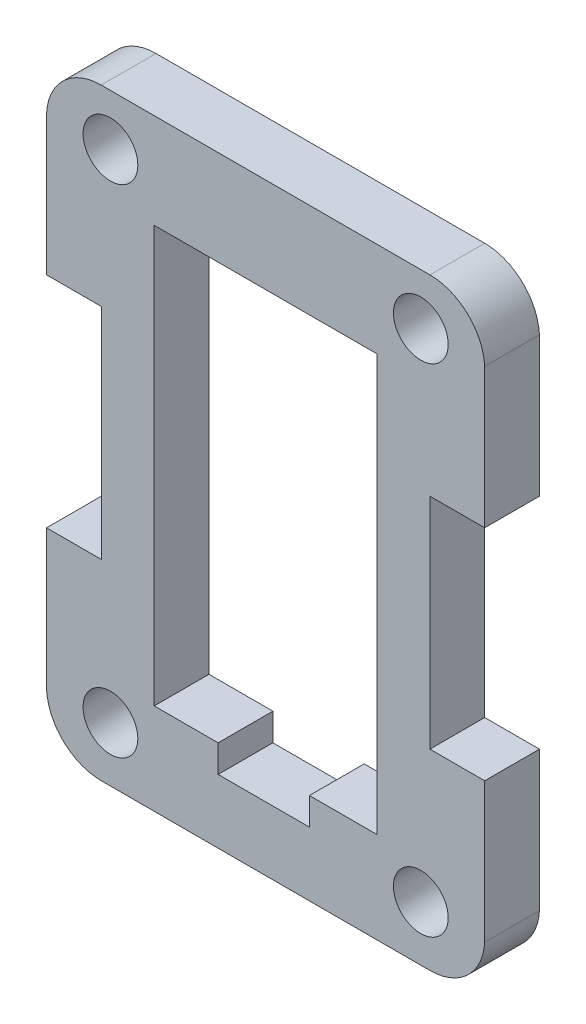
ISO-10303-21;
HEADER;
FILE_DESCRIPTION(('STEP AP214'),'2;1');
FILE_NAME('part.step','',(''),(''),'','','');
FILE_SCHEMA(('AUTOMOTIVE_DESIGN { 1 0 10303 214 1 1 1 1 }'));
ENDSEC;
DATA;
#1=APPLICATION_CONTEXT('core data for automotive mechanical design processes');
#2=APPLICATION_PROTOCOL_DEFINITION('international standard','automotive_design',2000,#1);
#3=PRODUCT_CONTEXT('',#1,'mechanical');
#4=PRODUCT('Part','Part','',(#3));
#5=PRODUCT_RELATED_PRODUCT_CATEGORY('part','',(#4));
#6=PRODUCT_DEFINITION_FORMATION('','',#4);
#7=PRODUCT_DEFINITION_CONTEXT('part definition',#1,'design');
#8=PRODUCT_DEFINITION('design','',#6,#7);
#9=PRODUCT_DEFINITION_SHAPE('','',#8);
#10=(LENGTH_UNIT() NAMED_UNIT(*) SI_UNIT(.MILLI.,.METRE.));
#11=(NAMED_UNIT(*) PLANE_ANGLE_UNIT() SI_UNIT($,.RADIAN.));
#12=(NAMED_UNIT(*) SI_UNIT($,.STERADIAN.) SOLID_ANGLE_UNIT());
#13=UNCERTAINTY_MEASURE_WITH_UNIT(LENGTH_MEASURE(1.E-05),#10,'distance_accuracy_value','');
#14=(GEOMETRIC_REPRESENTATION_CONTEXT(3) GLOBAL_UNCERTAINTY_ASSIGNED_CONTEXT((#13)) GLOBAL_UNIT_ASSIGNED_CONTEXT((#10,
#11,#12)) REPRESENTATION_CONTEXT('',''));
#15=CARTESIAN_POINT('',(0.,0.,0.));
#16=DIRECTION('',(0.,0.,1.));
#17=DIRECTION('',(1.,0.,0.));
#18=AXIS2_PLACEMENT_3D('',#15,#16,#17);
#19=CARTESIAN_POINT('',(44.9957202254101,26.4998748829452,3.));
#20=DIRECTION('',(0.,0.,1.));
#21=DIRECTION('',(1.,0.,0.));
#22=AXIS2_PLACEMENT_3D('',#19,#20,#21);
#23=PLANE('',#22);
#24=CARTESIAN_POINT('',(45.4999000000735,26.5000000049543,3.));
#25=DIRECTION('',(0.,0.,1.));
#26=DIRECTION('',(1.,0.,0.));
#27=AXIS2_PLACEMENT_3D('',#24,#25,#26);
#28=CIRCLE('',#27,1.50000000833415);
#29=CARTESIAN_POINT('',(46.9999000084077,26.5000000049543,3.));
#30=VERTEX_POINT('',#29);
#31=EDGE_CURVE('E266',#30,#30,#28,.T.);
#32=ORIENTED_EDGE('',*,*,#31,.F.);
#33=EDGE_LOOP('',(#32));
#34=FACE_BOUND('',#33,.T.);
#35=CARTESIAN_POINT('',(45.4999000000735,53.7000500066669,3.));
#36=DIRECTION('',(0.,0.,1.));
#37=DIRECTION('',(1.,0.,0.));
#38=AXIS2_PLACEMENT_3D('',#35,#36,#37);
#39=CIRCLE('',#38,1.5);
#40=CARTESIAN_POINT('',(46.9999000000735,53.7000500066669,3.));
#41=VERTEX_POINT('',#40);
#42=EDGE_CURVE('E278',#41,#41,#39,.T.);
#43=ORIENTED_EDGE('',*,*,#42,.F.);
#44=EDGE_LOOP('',(#43));
#45=FACE_BOUND('',#44,.T.);
#46=CARTESIAN_POINT('',(44.9957202254101,26.4998748829452,3.));
#47=DIRECTION('',(0.,0.,1.));
#48=DIRECTION('',(1.,0.,0.));
#49=AXIS2_PLACEMENT_3D('',#46,#47,#48);
#50=CIRCLE('',#49,2.99987488833183);
#51=CARTESIAN_POINT('',(41.99992086745,26.3435561301044,3.));
#52=VERTEX_POINT('',#51);
#53=CARTESIAN_POINT('',(44.9959,23.5,3.));
#54=VERTEX_POINT('',#53);
#55=EDGE_CURVE('E284',#52,#54,#50,.T.);
#56=ORIENTED_EDGE('',*,*,#55,.T.);
#57=DIRECTION('',(1.,0.,0.));
#58=VECTOR('',#57,1.);
#59=CARTESIAN_POINT('',(44.9959,23.5,3.));
#60=LINE('',#59,#58);
#61=CARTESIAN_POINT('',(62.9999000000001,23.5,3.));
#62=VERTEX_POINT('',#61);
#63=EDGE_CURVE('E287',#54,#62,#60,.T.);
#64=ORIENTED_EDGE('',*,*,#63,.T.);
#65=CARTESIAN_POINT('',(63.0041400352462,26.4998718918889,3.));
#66=DIRECTION('',(0.,0.,1.));
#67=DIRECTION('',(1.,0.,0.));
#68=AXIS2_PLACEMENT_3D('',#65,#66,#67);
#69=CIRCLE('',#68,2.99987488833178);
#70=CARTESIAN_POINT('',(65.9999,26.3428000000002,3.));
#71=VERTEX_POINT('',#70);
#72=EDGE_CURVE('E290',#62,#71,#69,.T.);
#73=ORIENTED_EDGE('',*,*,#72,.T.);
#74=DIRECTION('',(0.,1.,0.));
#75=VECTOR('',#74,1.);
#76=CARTESIAN_POINT('',(65.9999,34.,3.));
#77=LINE('',#76,#75);
#78=CARTESIAN_POINT('',(65.9999,34.,3.));
#79=VERTEX_POINT('',#78);
#80=EDGE_CURVE('E292',#71,#79,#77,.T.);
#81=ORIENTED_EDGE('',*,*,#80,.T.);
#82=DIRECTION('',(-1.,0.,0.));
#83=VECTOR('',#82,1.);
#84=CARTESIAN_POINT('',(65.9999,34.,3.));
#85=LINE('',#84,#83);
#86=CARTESIAN_POINT('',(62.9999,34.,3.));
#87=VERTEX_POINT('',#86);
#88=EDGE_CURVE('E294',#79,#87,#85,.T.);
#89=ORIENTED_EDGE('',*,*,#88,.T.);
#90=DIRECTION('',(0.,1.,0.));
#91=VECTOR('',#90,1.);
#92=CARTESIAN_POINT('',(62.9999,34.,3.));
#93=LINE('',#92,#91);
#94=CARTESIAN_POINT('',(62.9999,46.,3.));
#95=VERTEX_POINT('',#94);
#96=EDGE_CURVE('E296',#87,#95,#93,.T.);
#97=ORIENTED_EDGE('',*,*,#96,.T.);
#98=DIRECTION('',(1.,0.,0.));
#99=VECTOR('',#98,1.);
#100=CARTESIAN_POINT('',(62.9999,46.,3.));
#101=LINE('',#100,#99);
#102=CARTESIAN_POINT('',(65.9999,46.,3.));
#103=VERTEX_POINT('',#102);
#104=EDGE_CURVE('E298',#95,#103,#101,.T.);
#105=ORIENTED_EDGE('',*,*,#104,.T.);
#106=DIRECTION('',(0.,1.,0.));
#107=VECTOR('',#106,1.);
#108=CARTESIAN_POINT('',(65.9999,46.,3.));
#109=LINE('',#108,#107);
#110=CARTESIAN_POINT('',(65.9999,53.6572,3.));
#111=VERTEX_POINT('',#110);
#112=EDGE_CURVE('E300',#103,#111,#109,.T.);
#113=ORIENTED_EDGE('',*,*,#112,.T.);
#114=CARTESIAN_POINT('',(63.0041401530757,53.5001258608191,3.));
#115=DIRECTION('',(0.,0.,1.));
#116=DIRECTION('',(1.,0.,0.));
#117=AXIS2_PLACEMENT_3D('',#114,#115,#116);
#118=CIRCLE('',#117,2.99987488833176);
#119=CARTESIAN_POINT('',(63.0020200782864,56.5,3.));
#120=VERTEX_POINT('',#119);
#121=EDGE_CURVE('E302',#111,#120,#118,.T.);
#122=ORIENTED_EDGE('',*,*,#121,.T.);
#123=DIRECTION('',(-1.,0.,0.));
#124=VECTOR('',#123,1.);
#125=CARTESIAN_POINT('',(44.9937799217136,56.5,3.));
#126=LINE('',#125,#124);
#127=CARTESIAN_POINT('',(44.9937799217136,56.5,3.));
#128=VERTEX_POINT('',#127);
#129=EDGE_CURVE('E304',#120,#128,#126,.T.);
#130=ORIENTED_EDGE('',*,*,#129,.T.);
#131=CARTESIAN_POINT('',(44.9956409641021,53.5001256889387,3.));
#132=DIRECTION('',(0.,0.,1.));
#133=DIRECTION('',(1.,0.,0.));
#134=AXIS2_PLACEMENT_3D('',#131,#132,#133);
#135=CIRCLE('',#134,2.99987488833182);
#136=CARTESIAN_POINT('',(41.99992086745,53.6579561301045,3.));
#137=VERTEX_POINT('',#136);
#138=EDGE_CURVE('E306',#128,#137,#135,.T.);
#139=ORIENTED_EDGE('',*,*,#138,.T.);
#140=DIRECTION('',(0.,-1.,0.));
#141=VECTOR('',#140,1.);
#142=CARTESIAN_POINT('',(41.99992086745,53.6579561301045,3.));
#143=LINE('',#142,#141);
#144=CARTESIAN_POINT('',(41.99992086745,46.,3.));
#145=VERTEX_POINT('',#144);
#146=EDGE_CURVE('E308',#137,#145,#143,.T.);
#147=ORIENTED_EDGE('',*,*,#146,.T.);
#148=DIRECTION('',(1.,0.,0.));
#149=VECTOR('',#148,1.);
#150=CARTESIAN_POINT('',(41.99992086745,46.,3.));
#151=LINE('',#150,#149);
#152=CARTESIAN_POINT('',(44.99992086745,46.,3.));
#153=VERTEX_POINT('',#152);
#154=EDGE_CURVE('E310',#145,#153,#151,.T.);
#155=ORIENTED_EDGE('',*,*,#154,.T.);
#156=DIRECTION('',(0.,-1.,0.));
#157=VECTOR('',#156,1.);
#158=CARTESIAN_POINT('',(44.99992086745,46.,3.));
#159=LINE('',#158,#157);
#160=CARTESIAN_POINT('',(44.99992086745,34.,3.));
#161=VERTEX_POINT('',#160);
#162=EDGE_CURVE('E312',#153,#161,#159,.T.);
#163=ORIENTED_EDGE('',*,*,#162,.T.);
#164=DIRECTION('',(-1.,0.,0.));
#165=VECTOR('',#164,1.);
#166=CARTESIAN_POINT('',(44.99992086745,34.,3.));
#167=LINE('',#166,#165);
#168=CARTESIAN_POINT('',(41.99992086745,34.,3.));
#169=VERTEX_POINT('',#168);
#170=EDGE_CURVE('E314',#161,#169,#167,.T.);
#171=ORIENTED_EDGE('',*,*,#170,.T.);
#172=DIRECTION('',(0.,-1.,0.));
#173=VECTOR('',#172,1.);
#174=CARTESIAN_POINT('',(41.99992086745,34.,3.));
#175=LINE('',#174,#173);
#176=EDGE_CURVE('E316',#169,#52,#175,.T.);
#177=ORIENTED_EDGE('',*,*,#176,.T.);
#178=EDGE_LOOP('',(#56,#64,#73,#81,#89,#97,#105,#113,#122,#130,#139,#147,#155,#163,#171,#177));
#179=FACE_BOUND('',#178,.T.);
#180=CARTESIAN_POINT('',(62.4999,53.7000999981862,3.));
#181=DIRECTION('',(0.,0.,1.));
#182=DIRECTION('',(1.,0.,0.));
#183=AXIS2_PLACEMENT_3D('',#180,#181,#182);
#184=CIRCLE('',#183,1.50000000166673);
#185=CARTESIAN_POINT('',(63.9999000016668,53.7000999981862,3.));
#186=VERTEX_POINT('',#185);
#187=EDGE_CURVE('E272',#186,#186,#184,.T.);
#188=ORIENTED_EDGE('',*,*,#187,.F.);
#189=EDGE_LOOP('',(#188));
#190=FACE_BOUND('',#189,.T.);
#191=CARTESIAN_POINT('',(62.4999,26.5000499964736,3.));
#192=DIRECTION('',(0.,0.,1.));
#193=DIRECTION('',(1.,0.,0.));
#194=AXIS2_PLACEMENT_3D('',#191,#192,#193);
#195=CIRCLE('',#194,1.49999999999998);
#196=CARTESIAN_POINT('',(63.9999,26.5000499964736,3.));
#197=VERTEX_POINT('',#196);
#198=EDGE_CURVE('E260',#197,#197,#195,.T.);
#199=ORIENTED_EDGE('',*,*,#198,.F.);
#200=EDGE_LOOP('',(#199));
#201=FACE_BOUND('',#200,.T.);
#202=DIRECTION('',(0.,-1.,0.));
#203=VECTOR('',#202,1.);
#204=CARTESIAN_POINT('',(47.8979,51.3,3.));
#205=LINE('',#204,#203);
#206=CARTESIAN_POINT('',(47.8979,51.3,3.));
#207=VERTEX_POINT('',#206);
#208=CARTESIAN_POINT('',(47.8979,28.5,3.));
#209=VERTEX_POINT('',#208);
#210=EDGE_CURVE('E203',#207,#209,#205,.T.);
#211=ORIENTED_EDGE('',*,*,#210,.F.);
#212=DIRECTION('',(-1.,0.,0.));
#213=VECTOR('',#212,1.);
#214=CARTESIAN_POINT('',(60.0979,51.3,3.));
#215=LINE('',#214,#213);
#216=CARTESIAN_POINT('',(60.0979,51.3,3.));
#217=VERTEX_POINT('',#216);
#218=EDGE_CURVE('E195',#217,#207,#215,.T.);
#219=ORIENTED_EDGE('',*,*,#218,.F.);
#220=DIRECTION('',(0.,1.,0.));
#221=VECTOR('',#220,1.);
#222=CARTESIAN_POINT('',(60.0979,28.5,3.));
#223=LINE('',#222,#221);
#224=CARTESIAN_POINT('',(60.0979,28.5,3.));
#225=VERTEX_POINT('',#224);
#226=EDGE_CURVE('E228',#225,#217,#223,.T.);
#227=ORIENTED_EDGE('',*,*,#226,.F.);
#228=DIRECTION('',(1.,0.,0.));
#229=VECTOR('',#228,1.);
#230=CARTESIAN_POINT('',(56.3979,28.5,3.));
#231=LINE('',#230,#229);
#232=CARTESIAN_POINT('',(56.3979,28.5,3.));
#233=VERTEX_POINT('',#232);
#234=EDGE_CURVE('E226',#233,#225,#231,.T.);
#235=ORIENTED_EDGE('',*,*,#234,.F.);
#236=DIRECTION('',(0.,1.,0.));
#237=VECTOR('',#236,1.);
#238=CARTESIAN_POINT('',(56.3979,27.,3.));
#239=LINE('',#238,#237);
#240=CARTESIAN_POINT('',(56.3979,27.,3.));
#241=VERTEX_POINT('',#240);
#242=EDGE_CURVE('E224',#241,#233,#239,.T.);
#243=ORIENTED_EDGE('',*,*,#242,.F.);
#244=DIRECTION('',(1.,0.,0.));
#245=VECTOR('',#244,1.);
#246=CARTESIAN_POINT('',(51.3979,27.,3.));
#247=LINE('',#246,#245);
#248=CARTESIAN_POINT('',(51.3979,27.,3.));
#249=VERTEX_POINT('',#248);
#250=EDGE_CURVE('E222',#249,#241,#247,.T.);
#251=ORIENTED_EDGE('',*,*,#250,.F.);
#252=DIRECTION('',(0.,-1.,0.));
#253=VECTOR('',#252,1.);
#254=CARTESIAN_POINT('',(51.3979,28.5,3.));
#255=LINE('',#254,#253);
#256=CARTESIAN_POINT('',(51.3979,28.5,3.));
#257=VERTEX_POINT('',#256);
#258=EDGE_CURVE('E218',#257,#249,#255,.T.);
#259=ORIENTED_EDGE('',*,*,#258,.F.);
#260=DIRECTION('',(1.,0.,0.));
#261=VECTOR('',#260,1.);
#262=CARTESIAN_POINT('',(47.8979,28.5,3.));
#263=LINE('',#262,#261);
#264=EDGE_CURVE('E216',#209,#257,#263,.T.);
#265=ORIENTED_EDGE('',*,*,#264,.F.);
#266=EDGE_LOOP('',(#211,#219,#227,#235,#243,#251,#259,#265));
#267=FACE_BOUND('',#266,.T.);
#268=ADVANCED_FACE('F34',(#34,#45,#179,#190,#201,#267),#23,.T.);
#269=CARTESIAN_POINT('',(44.9957202254101,26.4998748829452,0.));
#270=DIRECTION('',(0.,0.,1.));
#271=DIRECTION('',(1.,0.,0.));
#272=AXIS2_PLACEMENT_3D('',#269,#270,#271);
#273=PLANE('',#272);
#274=CARTESIAN_POINT('',(62.4999,26.5000499964736,0.));
#275=DIRECTION('',(0.,0.,1.));
#276=DIRECTION('',(1.,0.,0.));
#277=AXIS2_PLACEMENT_3D('',#274,#275,#276);
#278=CIRCLE('',#277,1.49999999999998);
#279=CARTESIAN_POINT('',(63.9999,26.5000499964736,0.));
#280=VERTEX_POINT('',#279);
#281=EDGE_CURVE('E211',#280,#280,#278,.T.);
#282=ORIENTED_EDGE('',*,*,#281,.T.);
#283=EDGE_LOOP('',(#282));
#284=FACE_BOUND('',#283,.T.);
#285=CARTESIAN_POINT('',(45.4999000000735,26.5000000049543,0.));
#286=DIRECTION('',(0.,0.,1.));
#287=DIRECTION('',(1.,0.,0.));
#288=AXIS2_PLACEMENT_3D('',#285,#286,#287);
#289=CIRCLE('',#288,1.50000000833415);
#290=CARTESIAN_POINT('',(46.9999000084077,26.5000000049543,0.));
#291=VERTEX_POINT('',#290);
#292=EDGE_CURVE('E263',#291,#291,#289,.T.);
#293=ORIENTED_EDGE('',*,*,#292,.T.);
#294=EDGE_LOOP('',(#293));
#295=FACE_BOUND('',#294,.T.);
#296=CARTESIAN_POINT('',(62.4999,53.7000999981862,0.));
#297=DIRECTION('',(0.,0.,1.));
#298=DIRECTION('',(1.,0.,0.));
#299=AXIS2_PLACEMENT_3D('',#296,#297,#298);
#300=CIRCLE('',#299,1.50000000166673);
#301=CARTESIAN_POINT('',(63.9999000016668,53.7000999981862,0.));
#302=VERTEX_POINT('',#301);
#303=EDGE_CURVE('E269',#302,#302,#300,.T.);
#304=ORIENTED_EDGE('',*,*,#303,.T.);
#305=EDGE_LOOP('',(#304));
#306=FACE_BOUND('',#305,.T.);
#307=CARTESIAN_POINT('',(45.4999000000735,53.7000500066669,0.));
#308=DIRECTION('',(0.,0.,1.));
#309=DIRECTION('',(1.,0.,0.));
#310=AXIS2_PLACEMENT_3D('',#307,#308,#309);
#311=CIRCLE('',#310,1.5);
#312=CARTESIAN_POINT('',(46.9999000000735,53.7000500066669,0.));
#313=VERTEX_POINT('',#312);
#314=EDGE_CURVE('E275',#313,#313,#311,.T.);
#315=ORIENTED_EDGE('',*,*,#314,.T.);
#316=EDGE_LOOP('',(#315));
#317=FACE_BOUND('',#316,.T.);
#318=CARTESIAN_POINT('',(44.9957202254101,26.4998748829452,0.));
#319=DIRECTION('',(0.,0.,1.));
#320=DIRECTION('',(1.,0.,0.));
#321=AXIS2_PLACEMENT_3D('',#318,#319,#320);
#322=CIRCLE('',#321,2.99987488833183);
#323=CARTESIAN_POINT('',(41.99992086745,26.3435561301044,0.));
#324=VERTEX_POINT('',#323);
#325=CARTESIAN_POINT('',(44.9959,23.5,0.));
#326=VERTEX_POINT('',#325);
#327=EDGE_CURVE('E281',#324,#326,#322,.T.);
#328=ORIENTED_EDGE('',*,*,#327,.F.);
#329=DIRECTION('',(0.,-1.,0.));
#330=VECTOR('',#329,1.);
#331=CARTESIAN_POINT('',(41.99992086745,34.,0.));
#332=LINE('',#331,#330);
#333=CARTESIAN_POINT('',(41.99992086745,34.,0.));
#334=VERTEX_POINT('',#333);
#335=EDGE_CURVE('E288',#334,#324,#332,.T.);
#336=ORIENTED_EDGE('',*,*,#335,.F.);
#337=DIRECTION('',(-1.,0.,0.));
#338=VECTOR('',#337,1.);
#339=CARTESIAN_POINT('',(44.99992086745,34.,0.));
#340=LINE('',#339,#338);
#341=CARTESIAN_POINT('',(44.99992086745,34.,0.));
#342=VERTEX_POINT('',#341);
#343=EDGE_CURVE('E347',#342,#334,#340,.T.);
#344=ORIENTED_EDGE('',*,*,#343,.F.);
#345=DIRECTION('',(0.,-1.,0.));
#346=VECTOR('',#345,1.);
#347=CARTESIAN_POINT('',(44.99992086745,46.,0.));
#348=LINE('',#347,#346);
#349=CARTESIAN_POINT('',(44.99992086745,46.,0.));
#350=VERTEX_POINT('',#349);
#351=EDGE_CURVE('E345',#350,#342,#348,.T.);
#352=ORIENTED_EDGE('',*,*,#351,.F.);
#353=DIRECTION('',(1.,0.,0.));
#354=VECTOR('',#353,1.);
#355=CARTESIAN_POINT('',(41.99992086745,46.,0.));
#356=LINE('',#355,#354);
#357=CARTESIAN_POINT('',(41.99992086745,46.,0.));
#358=VERTEX_POINT('',#357);
#359=EDGE_CURVE('E343',#358,#350,#356,.T.);
#360=ORIENTED_EDGE('',*,*,#359,.F.);
#361=DIRECTION('',(0.,-1.,0.));
#362=VECTOR('',#361,1.);
#363=CARTESIAN_POINT('',(41.99992086745,53.6579561301045,0.));
#364=LINE('',#363,#362);
#365=CARTESIAN_POINT('',(41.99992086745,53.6579561301045,0.));
#366=VERTEX_POINT('',#365);
#367=EDGE_CURVE('E341',#366,#358,#364,.T.);
#368=ORIENTED_EDGE('',*,*,#367,.F.);
#369=CARTESIAN_POINT('',(44.9956409641021,53.5001256889387,0.));
#370=DIRECTION('',(0.,0.,1.));
#371=DIRECTION('',(1.,0.,0.));
#372=AXIS2_PLACEMENT_3D('',#369,#370,#371);
#373=CIRCLE('',#372,2.99987488833182);
#374=CARTESIAN_POINT('',(44.9937799217136,56.5,0.));
#375=VERTEX_POINT('',#374);
#376=EDGE_CURVE('E339',#375,#366,#373,.T.);
#377=ORIENTED_EDGE('',*,*,#376,.F.);
#378=DIRECTION('',(-1.,0.,0.));
#379=VECTOR('',#378,1.);
#380=CARTESIAN_POINT('',(44.9937799217136,56.5,0.));
#381=LINE('',#380,#379);
#382=CARTESIAN_POINT('',(63.0020200782864,56.5,0.));
#383=VERTEX_POINT('',#382);
#384=EDGE_CURVE('E337',#383,#375,#381,.T.);
#385=ORIENTED_EDGE('',*,*,#384,.F.);
#386=CARTESIAN_POINT('',(63.0041401530757,53.5001258608191,0.));
#387=DIRECTION('',(0.,0.,1.));
#388=DIRECTION('',(1.,0.,0.));
#389=AXIS2_PLACEMENT_3D('',#386,#387,#388);
#390=CIRCLE('',#389,2.99987488833176);
#391=CARTESIAN_POINT('',(65.9999,53.6572,0.));
#392=VERTEX_POINT('',#391);
#393=EDGE_CURVE('E335',#392,#383,#390,.T.);
#394=ORIENTED_EDGE('',*,*,#393,.F.);
#395=DIRECTION('',(0.,1.,0.));
#396=VECTOR('',#395,1.);
#397=CARTESIAN_POINT('',(65.9999,46.,0.));
#398=LINE('',#397,#396);
#399=CARTESIAN_POINT('',(65.9999,46.,0.));
#400=VERTEX_POINT('',#399);
#401=EDGE_CURVE('E333',#400,#392,#398,.T.);
#402=ORIENTED_EDGE('',*,*,#401,.F.);
#403=DIRECTION('',(1.,0.,0.));
#404=VECTOR('',#403,1.);
#405=CARTESIAN_POINT('',(62.9999,46.,0.));
#406=LINE('',#405,#404);
#407=CARTESIAN_POINT('',(62.9999,46.,0.));
#408=VERTEX_POINT('',#407);
#409=EDGE_CURVE('E331',#408,#400,#406,.T.);
#410=ORIENTED_EDGE('',*,*,#409,.F.);
#411=DIRECTION('',(0.,1.,0.));
#412=VECTOR('',#411,1.);
#413=CARTESIAN_POINT('',(62.9999,34.,0.));
#414=LINE('',#413,#412);
#415=CARTESIAN_POINT('',(62.9999,34.,0.));
#416=VERTEX_POINT('',#415);
#417=EDGE_CURVE('E329',#416,#408,#414,.T.);
#418=ORIENTED_EDGE('',*,*,#417,.F.);
#419=DIRECTION('',(-1.,0.,0.));
#420=VECTOR('',#419,1.);
#421=CARTESIAN_POINT('',(65.9999,34.,0.));
#422=LINE('',#421,#420);
#423=CARTESIAN_POINT('',(65.9999,34.,0.));
#424=VERTEX_POINT('',#423);
#425=EDGE_CURVE('E327',#424,#416,#422,.T.);
#426=ORIENTED_EDGE('',*,*,#425,.F.);
#427=DIRECTION('',(0.,1.,0.));
#428=VECTOR('',#427,1.);
#429=CARTESIAN_POINT('',(65.9999,34.,0.));
#430=LINE('',#429,#428);
#431=CARTESIAN_POINT('',(65.9999,26.3428000000002,0.));
#432=VERTEX_POINT('',#431);
#433=EDGE_CURVE('E325',#432,#424,#430,.T.);
#434=ORIENTED_EDGE('',*,*,#433,.F.);
#435=CARTESIAN_POINT('',(63.0041400352462,26.4998718918889,0.));
#436=DIRECTION('',(0.,0.,1.));
#437=DIRECTION('',(1.,0.,0.));
#438=AXIS2_PLACEMENT_3D('',#435,#436,#437);
#439=CIRCLE('',#438,2.99987488833178);
#440=CARTESIAN_POINT('',(62.9999000000001,23.5,0.));
#441=VERTEX_POINT('',#440);
#442=EDGE_CURVE('E323',#441,#432,#439,.T.);
#443=ORIENTED_EDGE('',*,*,#442,.F.);
#444=DIRECTION('',(1.,0.,0.));
#445=VECTOR('',#444,1.);
#446=CARTESIAN_POINT('',(44.9959,23.5,0.));
#447=LINE('',#446,#445);
#448=EDGE_CURVE('E321',#326,#441,#447,.T.);
#449=ORIENTED_EDGE('',*,*,#448,.F.);
#450=EDGE_LOOP('',(#328,#336,#344,#352,#360,#368,#377,#385,#394,#402,#410,#418,#426,#434,#443,#449));
#451=FACE_BOUND('',#450,.T.);
#452=DIRECTION('',(-1.,0.,0.));
#453=VECTOR('',#452,1.);
#454=CARTESIAN_POINT('',(60.0979,51.3,0.));
#455=LINE('',#454,#453);
#456=CARTESIAN_POINT('',(60.0979,51.3,0.));
#457=VERTEX_POINT('',#456);
#458=CARTESIAN_POINT('',(47.8979,51.3,0.));
#459=VERTEX_POINT('',#458);
#460=EDGE_CURVE('E57',#457,#459,#455,.T.);
#461=ORIENTED_EDGE('',*,*,#460,.T.);
#462=DIRECTION('',(0.,-1.,0.));
#463=VECTOR('',#462,1.);
#464=CARTESIAN_POINT('',(47.8979,51.3,0.));
#465=LINE('',#464,#463);
#466=CARTESIAN_POINT('',(47.8979,28.5,0.));
#467=VERTEX_POINT('',#466);
#468=EDGE_CURVE('E210',#459,#467,#465,.T.);
#469=ORIENTED_EDGE('',*,*,#468,.T.);
#470=DIRECTION('',(1.,0.,0.));
#471=VECTOR('',#470,1.);
#472=CARTESIAN_POINT('',(47.8979,28.5,0.));
#473=LINE('',#472,#471);
#474=CARTESIAN_POINT('',(51.3979,28.5,0.));
#475=VERTEX_POINT('',#474);
#476=EDGE_CURVE('E232',#467,#475,#473,.T.);
#477=ORIENTED_EDGE('',*,*,#476,.T.);
#478=DIRECTION('',(0.,-1.,0.));
#479=VECTOR('',#478,1.);
#480=CARTESIAN_POINT('',(51.3979,28.5,0.));
#481=LINE('',#480,#479);
#482=CARTESIAN_POINT('',(51.3979,27.,0.));
#483=VERTEX_POINT('',#482);
#484=EDGE_CURVE('E235',#475,#483,#481,.T.);
#485=ORIENTED_EDGE('',*,*,#484,.T.);
#486=DIRECTION('',(1.,0.,0.));
#487=VECTOR('',#486,1.);
#488=CARTESIAN_POINT('',(51.3979,27.,0.));
#489=LINE('',#488,#487);
#490=CARTESIAN_POINT('',(56.3979,27.,0.));
#491=VERTEX_POINT('',#490);
#492=EDGE_CURVE('E238',#483,#491,#489,.T.);
#493=ORIENTED_EDGE('',*,*,#492,.T.);
#494=DIRECTION('',(0.,1.,0.));
#495=VECTOR('',#494,1.);
#496=CARTESIAN_POINT('',(56.3979,27.,0.));
#497=LINE('',#496,#495);
#498=CARTESIAN_POINT('',(56.3979,28.5,0.));
#499=VERTEX_POINT('',#498);
#500=EDGE_CURVE('E241',#491,#499,#497,.T.);
#501=ORIENTED_EDGE('',*,*,#500,.T.);
#502=DIRECTION('',(1.,0.,0.));
#503=VECTOR('',#502,1.);
#504=CARTESIAN_POINT('',(56.3979,28.5,0.));
#505=LINE('',#504,#503);
#506=CARTESIAN_POINT('',(60.0979,28.5,0.));
#507=VERTEX_POINT('',#506);
#508=EDGE_CURVE('E244',#499,#507,#505,.T.);
#509=ORIENTED_EDGE('',*,*,#508,.T.);
#510=DIRECTION('',(0.,1.,0.));
#511=VECTOR('',#510,1.);
#512=CARTESIAN_POINT('',(60.0979,28.5,0.));
#513=LINE('',#512,#511);
#514=EDGE_CURVE('E204',#507,#457,#513,.T.);
#515=ORIENTED_EDGE('',*,*,#514,.T.);
#516=EDGE_LOOP('',(#461,#469,#477,#485,#493,#501,#509,#515));
#517=FACE_BOUND('',#516,.T.);
#518=ADVANCED_FACE('F401',(#284,#295,#306,#317,#451,#517),#273,.F.);
#519=CARTESIAN_POINT('',(44.9957202254101,26.4998748829452,3.));
#520=DIRECTION('',(0.,0.,-1.));
#521=DIRECTION('',(-1.,0.,0.));
#522=AXIS2_PLACEMENT_3D('',#519,#520,#521);
#523=CYLINDRICAL_SURFACE('',#522,2.99987488833183);
#524=ORIENTED_EDGE('',*,*,#327,.T.);
#525=DIRECTION('',(0.,0.,-1.));
#526=VECTOR('',#525,1.);
#527=CARTESIAN_POINT('',(44.9959,23.5,3.));
#528=LINE('',#527,#526);
#529=EDGE_CURVE('E11',#54,#326,#528,.T.);
#530=ORIENTED_EDGE('',*,*,#529,.F.);
#531=ORIENTED_EDGE('',*,*,#55,.F.);
#532=DIRECTION('',(0.,0.,-1.));
#533=VECTOR('',#532,1.);
#534=CARTESIAN_POINT('',(41.99992086745,26.3435561301044,3.));
#535=LINE('',#534,#533);
#536=EDGE_CURVE('E318',#52,#324,#535,.T.);
#537=ORIENTED_EDGE('',*,*,#536,.T.);
#538=EDGE_LOOP('',(#524,#530,#531,#537));
#539=FACE_BOUND('',#538,.T.);
#540=ADVANCED_FACE('F36',(#539),#523,.T.);
#541=CARTESIAN_POINT('',(44.9959,23.5,3.));
#542=DIRECTION('',(0.,1.,0.));
#543=DIRECTION('',(-1.,0.,0.));
#544=AXIS2_PLACEMENT_3D('',#541,#542,#543);
#545=PLANE('',#544);
#546=ORIENTED_EDGE('',*,*,#448,.T.);
#547=DIRECTION('',(0.,0.,-1.));
#548=VECTOR('',#547,1.);
#549=CARTESIAN_POINT('',(62.9999000000001,23.5,3.));
#550=LINE('',#549,#548);
#551=EDGE_CURVE('E42',#62,#441,#550,.T.);
#552=ORIENTED_EDGE('',*,*,#551,.F.);
#553=ORIENTED_EDGE('',*,*,#63,.F.);
#554=ORIENTED_EDGE('',*,*,#529,.T.);
#555=EDGE_LOOP('',(#546,#552,#553,#554));
#556=FACE_BOUND('',#555,.T.);
#557=ADVANCED_FACE('F419',(#556),#545,.F.);
#558=CARTESIAN_POINT('',(63.0041400352462,26.4998718918889,3.));
#559=DIRECTION('',(0.,0.,-1.));
#560=DIRECTION('',(-1.,0.,0.));
#561=AXIS2_PLACEMENT_3D('',#558,#559,#560);
#562=CYLINDRICAL_SURFACE('',#561,2.99987488833178);
#563=ORIENTED_EDGE('',*,*,#442,.T.);
#564=DIRECTION('',(0.,0.,-1.));
#565=VECTOR('',#564,1.);
#566=CARTESIAN_POINT('',(65.9999,26.3428000000002,3.));
#567=LINE('',#566,#565);
#568=EDGE_CURVE('E388',#71,#432,#567,.T.);
#569=ORIENTED_EDGE('',*,*,#568,.F.);
#570=ORIENTED_EDGE('',*,*,#72,.F.);
#571=ORIENTED_EDGE('',*,*,#551,.T.);
#572=EDGE_LOOP('',(#563,#569,#570,#571));
#573=FACE_BOUND('',#572,.T.);
#574=ADVANCED_FACE('F395',(#573),#562,.T.);
#575=CARTESIAN_POINT('',(65.9999,34.,3.));
#576=DIRECTION('',(-1.,0.,0.));
#577=DIRECTION('',(0.,0.,1.));
#578=AXIS2_PLACEMENT_3D('',#575,#576,#577);
#579=PLANE('',#578);
#580=ORIENTED_EDGE('',*,*,#433,.T.);
#581=DIRECTION('',(0.,0.,-1.));
#582=VECTOR('',#581,1.);
#583=CARTESIAN_POINT('',(65.9999,34.,3.));
#584=LINE('',#583,#582);
#585=EDGE_CURVE('E385',#79,#424,#584,.T.);
#586=ORIENTED_EDGE('',*,*,#585,.F.);
#587=ORIENTED_EDGE('',*,*,#80,.F.);
#588=ORIENTED_EDGE('',*,*,#568,.T.);
#589=EDGE_LOOP('',(#580,#586,#587,#588));
#590=FACE_BOUND('',#589,.T.);
#591=ADVANCED_FACE('F407',(#590),#579,.F.);
#592=CARTESIAN_POINT('',(65.9999,34.,3.));
#593=DIRECTION('',(0.,-1.,0.));
#594=DIRECTION('',(0.,0.,-1.));
#595=AXIS2_PLACEMENT_3D('',#592,#593,#594);
#596=PLANE('',#595);
#597=ORIENTED_EDGE('',*,*,#425,.T.);
#598=DIRECTION('',(0.,0.,-1.));
#599=VECTOR('',#598,1.);
#600=CARTESIAN_POINT('',(62.9999,34.,3.));
#601=LINE('',#600,#599);
#602=EDGE_CURVE('E382',#87,#416,#601,.T.);
#603=ORIENTED_EDGE('',*,*,#602,.F.);
#604=ORIENTED_EDGE('',*,*,#88,.F.);
#605=ORIENTED_EDGE('',*,*,#585,.T.);
#606=EDGE_LOOP('',(#597,#603,#604,#605));
#607=FACE_BOUND('',#606,.T.);
#608=ADVANCED_FACE('F411',(#607),#596,.F.);
#609=CARTESIAN_POINT('',(62.9999,34.,3.));
#610=DIRECTION('',(-1.,0.,0.));
#611=DIRECTION('',(0.,0.,1.));
#612=AXIS2_PLACEMENT_3D('',#609,#610,#611);
#613=PLANE('',#612);
#614=ORIENTED_EDGE('',*,*,#417,.T.);
#615=DIRECTION('',(0.,0.,-1.));
#616=VECTOR('',#615,1.);
#617=CARTESIAN_POINT('',(62.9999,46.,3.));
#618=LINE('',#617,#616);
#619=EDGE_CURVE('E379',#95,#408,#618,.T.);
#620=ORIENTED_EDGE('',*,*,#619,.F.);
#621=ORIENTED_EDGE('',*,*,#96,.F.);
#622=ORIENTED_EDGE('',*,*,#602,.T.);
#623=EDGE_LOOP('',(#614,#620,#621,#622));
#624=FACE_BOUND('',#623,.T.);
#625=ADVANCED_FACE('F472',(#624),#613,.F.);
#626=CARTESIAN_POINT('',(62.9999,46.,3.));
#627=DIRECTION('',(0.,1.,0.));
#628=DIRECTION('',(0.,0.,1.));
#629=AXIS2_PLACEMENT_3D('',#626,#627,#628);
#630=PLANE('',#629);
#631=ORIENTED_EDGE('',*,*,#409,.T.);
#632=DIRECTION('',(0.,0.,-1.));
#633=VECTOR('',#632,1.);
#634=CARTESIAN_POINT('',(65.9999,46.,3.));
#635=LINE('',#634,#633);
#636=EDGE_CURVE('E376',#103,#400,#635,.T.);
#637=ORIENTED_EDGE('',*,*,#636,.F.);
#638=ORIENTED_EDGE('',*,*,#104,.F.);
#639=ORIENTED_EDGE('',*,*,#619,.T.);
#640=EDGE_LOOP('',(#631,#637,#638,#639));
#641=FACE_BOUND('',#640,.T.);
#642=ADVANCED_FACE('F469',(#641),#630,.F.);
#643=CARTESIAN_POINT('',(65.9999,46.,3.));
#644=DIRECTION('',(-1.,0.,0.));
#645=DIRECTION('',(0.,-1.,0.));
#646=AXIS2_PLACEMENT_3D('',#643,#644,#645);
#647=PLANE('',#646);
#648=ORIENTED_EDGE('',*,*,#401,.T.);
#649=DIRECTION('',(0.,0.,-1.));
#650=VECTOR('',#649,1.);
#651=CARTESIAN_POINT('',(65.9999,53.6572,3.));
#652=LINE('',#651,#650);
#653=EDGE_CURVE('E373',#111,#392,#652,.T.);
#654=ORIENTED_EDGE('',*,*,#653,.F.);
#655=ORIENTED_EDGE('',*,*,#112,.F.);
#656=ORIENTED_EDGE('',*,*,#636,.T.);
#657=EDGE_LOOP('',(#648,#654,#655,#656));
#658=FACE_BOUND('',#657,.T.);
#659=ADVANCED_FACE('F465',(#658),#647,.F.);
#660=CARTESIAN_POINT('',(63.0041401530757,53.5001258608191,3.));
#661=DIRECTION('',(0.,0.,-1.));
#662=DIRECTION('',(-1.,0.,0.));
#663=AXIS2_PLACEMENT_3D('',#660,#661,#662);
#664=CYLINDRICAL_SURFACE('',#663,2.99987488833176);
#665=ORIENTED_EDGE('',*,*,#393,.T.);
#666=DIRECTION('',(0.,0.,-1.));
#667=VECTOR('',#666,1.);
#668=CARTESIAN_POINT('',(63.0020200782864,56.5,3.));
#669=LINE('',#668,#667);
#670=EDGE_CURVE('E370',#120,#383,#669,.T.);
#671=ORIENTED_EDGE('',*,*,#670,.F.);
#672=ORIENTED_EDGE('',*,*,#121,.F.);
#673=ORIENTED_EDGE('',*,*,#653,.T.);
#674=EDGE_LOOP('',(#665,#671,#672,#673));
#675=FACE_BOUND('',#674,.T.);
#676=ADVANCED_FACE('F461',(#675),#664,.T.);
#677=CARTESIAN_POINT('',(44.9937799217136,56.5,3.));
#678=DIRECTION('',(0.,-1.,0.));
#679=DIRECTION('',(0.,0.,-1.));
#680=AXIS2_PLACEMENT_3D('',#677,#678,#679);
#681=PLANE('',#680);
#682=ORIENTED_EDGE('',*,*,#384,.T.);
#683=DIRECTION('',(0.,0.,-1.));
#684=VECTOR('',#683,1.);
#685=CARTESIAN_POINT('',(44.9937799217136,56.5,3.));
#686=LINE('',#685,#684);
#687=EDGE_CURVE('E367',#128,#375,#686,.T.);
#688=ORIENTED_EDGE('',*,*,#687,.F.);
#689=ORIENTED_EDGE('',*,*,#129,.F.);
#690=ORIENTED_EDGE('',*,*,#670,.T.);
#691=EDGE_LOOP('',(#682,#688,#689,#690));
#692=FACE_BOUND('',#691,.T.);
#693=ADVANCED_FACE('F456',(#692),#681,.F.);
#694=CARTESIAN_POINT('',(44.9956409641021,53.5001256889387,3.));
#695=DIRECTION('',(0.,0.,-1.));
#696=DIRECTION('',(-1.,0.,0.));
#697=AXIS2_PLACEMENT_3D('',#694,#695,#696);
#698=CYLINDRICAL_SURFACE('',#697,2.99987488833182);
#699=ORIENTED_EDGE('',*,*,#376,.T.);
#700=DIRECTION('',(0.,0.,-1.));
#701=VECTOR('',#700,1.);
#702=CARTESIAN_POINT('',(41.99992086745,53.6579561301045,3.));
#703=LINE('',#702,#701);
#704=EDGE_CURVE('E364',#137,#366,#703,.T.);
#705=ORIENTED_EDGE('',*,*,#704,.F.);
#706=ORIENTED_EDGE('',*,*,#138,.F.);
#707=ORIENTED_EDGE('',*,*,#687,.T.);
#708=EDGE_LOOP('',(#699,#705,#706,#707));
#709=FACE_BOUND('',#708,.T.);
#710=ADVANCED_FACE('F450',(#709),#698,.T.);
#711=CARTESIAN_POINT('',(41.99992086745,53.6579561301045,3.));
#712=DIRECTION('',(1.,0.,0.));
#713=DIRECTION('',(0.,1.,0.));
#714=AXIS2_PLACEMENT_3D('',#711,#712,#713);
#715=PLANE('',#714);
#716=ORIENTED_EDGE('',*,*,#367,.T.);
#717=DIRECTION('',(0.,0.,-1.));
#718=VECTOR('',#717,1.);
#719=CARTESIAN_POINT('',(41.99992086745,46.,3.));
#720=LINE('',#719,#718);
#721=EDGE_CURVE('E361',#145,#358,#720,.T.);
#722=ORIENTED_EDGE('',*,*,#721,.F.);
#723=ORIENTED_EDGE('',*,*,#146,.F.);
#724=ORIENTED_EDGE('',*,*,#704,.T.);
#725=EDGE_LOOP('',(#716,#722,#723,#724));
#726=FACE_BOUND('',#725,.T.);
#727=ADVANCED_FACE('F446',(#726),#715,.F.);
#728=CARTESIAN_POINT('',(41.99992086745,46.,3.));
#729=DIRECTION('',(0.,1.,0.));
#730=DIRECTION('',(0.,0.,1.));
#731=AXIS2_PLACEMENT_3D('',#728,#729,#730);
#732=PLANE('',#731);
#733=ORIENTED_EDGE('',*,*,#359,.T.);
#734=DIRECTION('',(0.,0.,-1.));
#735=VECTOR('',#734,1.);
#736=CARTESIAN_POINT('',(44.99992086745,46.,3.));
#737=LINE('',#736,#735);
#738=EDGE_CURVE('E358',#153,#350,#737,.T.);
#739=ORIENTED_EDGE('',*,*,#738,.F.);
#740=ORIENTED_EDGE('',*,*,#154,.F.);
#741=ORIENTED_EDGE('',*,*,#721,.T.);
#742=EDGE_LOOP('',(#733,#739,#740,#741));
#743=FACE_BOUND('',#742,.T.);
#744=ADVANCED_FACE('F441',(#743),#732,.F.);
#745=CARTESIAN_POINT('',(44.99992086745,46.,3.));
#746=DIRECTION('',(1.,0.,0.));
#747=DIRECTION('',(0.,1.,0.));
#748=AXIS2_PLACEMENT_3D('',#745,#746,#747);
#749=PLANE('',#748);
#750=ORIENTED_EDGE('',*,*,#351,.T.);
#751=DIRECTION('',(0.,0.,-1.));
#752=VECTOR('',#751,1.);
#753=CARTESIAN_POINT('',(44.99992086745,34.,3.));
#754=LINE('',#753,#752);
#755=EDGE_CURVE('E355',#161,#342,#754,.T.);
#756=ORIENTED_EDGE('',*,*,#755,.F.);
#757=ORIENTED_EDGE('',*,*,#162,.F.);
#758=ORIENTED_EDGE('',*,*,#738,.T.);
#759=EDGE_LOOP('',(#750,#756,#757,#758));
#760=FACE_BOUND('',#759,.T.);
#761=ADVANCED_FACE('F435',(#760),#749,.F.);
#762=CARTESIAN_POINT('',(44.99992086745,34.,3.));
#763=DIRECTION('',(0.,-1.,0.));
#764=DIRECTION('',(0.,0.,-1.));
#765=AXIS2_PLACEMENT_3D('',#762,#763,#764);
#766=PLANE('',#765);
#767=ORIENTED_EDGE('',*,*,#343,.T.);
#768=DIRECTION('',(0.,0.,-1.));
#769=VECTOR('',#768,1.);
#770=CARTESIAN_POINT('',(41.99992086745,34.,3.));
#771=LINE('',#770,#769);
#772=EDGE_CURVE('E352',#169,#334,#771,.T.);
#773=ORIENTED_EDGE('',*,*,#772,.F.);
#774=ORIENTED_EDGE('',*,*,#170,.F.);
#775=ORIENTED_EDGE('',*,*,#755,.T.);
#776=EDGE_LOOP('',(#767,#773,#774,#775));
#777=FACE_BOUND('',#776,.T.);
#778=ADVANCED_FACE('F431',(#777),#766,.F.);
#779=CARTESIAN_POINT('',(41.99992086745,34.,3.));
#780=DIRECTION('',(1.,0.,0.));
#781=DIRECTION('',(0.,1.,0.));
#782=AXIS2_PLACEMENT_3D('',#779,#780,#781);
#783=PLANE('',#782);
#784=ORIENTED_EDGE('',*,*,#335,.T.);
#785=ORIENTED_EDGE('',*,*,#536,.F.);
#786=ORIENTED_EDGE('',*,*,#176,.F.);
#787=ORIENTED_EDGE('',*,*,#772,.T.);
#788=EDGE_LOOP('',(#784,#785,#786,#787));
#789=FACE_BOUND('',#788,.T.);
#790=ADVANCED_FACE('F426',(#789),#783,.F.);
#791=CARTESIAN_POINT('',(45.4999000000735,53.7000500066669,3.));
#792=DIRECTION('',(0.,0.,-1.));
#793=DIRECTION('',(-1.,0.,0.));
#794=AXIS2_PLACEMENT_3D('',#791,#792,#793);
#795=CYLINDRICAL_SURFACE('',#794,1.5);
#796=ORIENTED_EDGE('',*,*,#42,.T.);
#797=EDGE_LOOP('',(#796));
#798=FACE_BOUND('',#797,.T.);
#799=ORIENTED_EDGE('',*,*,#314,.F.);
#800=EDGE_LOOP('',(#799));
#801=FACE_BOUND('',#800,.T.);
#802=ADVANCED_FACE('F492',(#798,#801),#795,.F.);
#803=CARTESIAN_POINT('',(62.4999,53.7000999981862,3.));
#804=DIRECTION('',(0.,0.,-1.));
#805=DIRECTION('',(-1.,0.,0.));
#806=AXIS2_PLACEMENT_3D('',#803,#804,#805);
#807=CYLINDRICAL_SURFACE('',#806,1.50000000166673);
#808=ORIENTED_EDGE('',*,*,#187,.T.);
#809=EDGE_LOOP('',(#808));
#810=FACE_BOUND('',#809,.T.);
#811=ORIENTED_EDGE('',*,*,#303,.F.);
#812=EDGE_LOOP('',(#811));
#813=FACE_BOUND('',#812,.T.);
#814=ADVANCED_FACE('F554',(#810,#813),#807,.F.);
#815=CARTESIAN_POINT('',(45.4999000000735,26.5000000049543,3.));
#816=DIRECTION('',(0.,0.,-1.));
#817=DIRECTION('',(-1.,0.,0.));
#818=AXIS2_PLACEMENT_3D('',#815,#816,#817);
#819=CYLINDRICAL_SURFACE('',#818,1.50000000833415);
#820=ORIENTED_EDGE('',*,*,#31,.T.);
#821=EDGE_LOOP('',(#820));
#822=FACE_BOUND('',#821,.T.);
#823=ORIENTED_EDGE('',*,*,#292,.F.);
#824=EDGE_LOOP('',(#823));
#825=FACE_BOUND('',#824,.T.);
#826=ADVANCED_FACE('F561',(#822,#825),#819,.F.);
#827=CARTESIAN_POINT('',(62.4999,26.5000499964736,3.));
#828=DIRECTION('',(0.,0.,-1.));
#829=DIRECTION('',(-1.,0.,0.));
#830=AXIS2_PLACEMENT_3D('',#827,#828,#829);
#831=CYLINDRICAL_SURFACE('',#830,1.49999999999998);
#832=ORIENTED_EDGE('',*,*,#198,.T.);
#833=EDGE_LOOP('',(#832));
#834=FACE_BOUND('',#833,.T.);
#835=ORIENTED_EDGE('',*,*,#281,.F.);
#836=EDGE_LOOP('',(#835));
#837=FACE_BOUND('',#836,.T.);
#838=ADVANCED_FACE('F568',(#834,#837),#831,.F.);
#839=CARTESIAN_POINT('',(60.0979,51.3,3.));
#840=DIRECTION('',(0.,-1.,0.));
#841=DIRECTION('',(1.,0.,0.));
#842=AXIS2_PLACEMENT_3D('',#839,#840,#841);
#843=PLANE('',#842);
#844=ORIENTED_EDGE('',*,*,#460,.F.);
#845=DIRECTION('',(0.,0.,-1.));
#846=VECTOR('',#845,1.);
#847=CARTESIAN_POINT('',(60.0979,51.3,3.));
#848=LINE('',#847,#846);
#849=EDGE_CURVE('E199',#217,#457,#848,.T.);
#850=ORIENTED_EDGE('',*,*,#849,.F.);
#851=ORIENTED_EDGE('',*,*,#218,.T.);
#852=DIRECTION('',(0.,0.,-1.));
#853=VECTOR('',#852,1.);
#854=CARTESIAN_POINT('',(47.8979,51.3,3.));
#855=LINE('',#854,#853);
#856=EDGE_CURVE('E198',#207,#459,#855,.T.);
#857=ORIENTED_EDGE('',*,*,#856,.T.);
#858=EDGE_LOOP('',(#844,#850,#851,#857));
#859=FACE_BOUND('',#858,.T.);
#860=ADVANCED_FACE('F197',(#859),#843,.T.);
#861=CARTESIAN_POINT('',(47.8979,51.3,3.));
#862=DIRECTION('',(1.,0.,0.));
#863=DIRECTION('',(0.,1.,0.));
#864=AXIS2_PLACEMENT_3D('',#861,#862,#863);
#865=PLANE('',#864);
#866=ORIENTED_EDGE('',*,*,#468,.F.);
#867=ORIENTED_EDGE('',*,*,#856,.F.);
#868=ORIENTED_EDGE('',*,*,#210,.T.);
#869=DIRECTION('',(0.,0.,-1.));
#870=VECTOR('',#869,1.);
#871=CARTESIAN_POINT('',(47.8979,28.5,3.));
#872=LINE('',#871,#870);
#873=EDGE_CURVE('E212',#209,#467,#872,.T.);
#874=ORIENTED_EDGE('',*,*,#873,.T.);
#875=EDGE_LOOP('',(#866,#867,#868,#874));
#876=FACE_BOUND('',#875,.T.);
#877=ADVANCED_FACE('F207',(#876),#865,.T.);
#878=CARTESIAN_POINT('',(47.8979,28.5,3.));
#879=DIRECTION('',(0.,1.,0.));
#880=DIRECTION('',(0.,0.,1.));
#881=AXIS2_PLACEMENT_3D('',#878,#879,#880);
#882=PLANE('',#881);
#883=ORIENTED_EDGE('',*,*,#476,.F.);
#884=ORIENTED_EDGE('',*,*,#873,.F.);
#885=ORIENTED_EDGE('',*,*,#264,.T.);
#886=DIRECTION('',(0.,0.,-1.));
#887=VECTOR('',#886,1.);
#888=CARTESIAN_POINT('',(51.3979,28.5,3.));
#889=LINE('',#888,#887);
#890=EDGE_CURVE('E257',#257,#475,#889,.T.);
#891=ORIENTED_EDGE('',*,*,#890,.T.);
#892=EDGE_LOOP('',(#883,#884,#885,#891));
#893=FACE_BOUND('',#892,.T.);
#894=ADVANCED_FACE('F589',(#893),#882,.T.);
#895=CARTESIAN_POINT('',(51.3979,28.5,3.));
#896=DIRECTION('',(1.,0.,0.));
#897=DIRECTION('',(0.,1.,0.));
#898=AXIS2_PLACEMENT_3D('',#895,#896,#897);
#899=PLANE('',#898);
#900=ORIENTED_EDGE('',*,*,#484,.F.);
#901=ORIENTED_EDGE('',*,*,#890,.F.);
#902=ORIENTED_EDGE('',*,*,#258,.T.);
#903=DIRECTION('',(0.,0.,-1.));
#904=VECTOR('',#903,1.);
#905=CARTESIAN_POINT('',(51.3979,27.,3.));
#906=LINE('',#905,#904);
#907=EDGE_CURVE('E255',#249,#483,#906,.T.);
#908=ORIENTED_EDGE('',*,*,#907,.T.);
#909=EDGE_LOOP('',(#900,#901,#902,#908));
#910=FACE_BOUND('',#909,.T.);
#911=ADVANCED_FACE('F596',(#910),#899,.T.);
#912=CARTESIAN_POINT('',(51.3979,27.,3.));
#913=DIRECTION('',(0.,1.,0.));
#914=DIRECTION('',(0.,0.,1.));
#915=AXIS2_PLACEMENT_3D('',#912,#913,#914);
#916=PLANE('',#915);
#917=ORIENTED_EDGE('',*,*,#492,.F.);
#918=ORIENTED_EDGE('',*,*,#907,.F.);
#919=ORIENTED_EDGE('',*,*,#250,.T.);
#920=DIRECTION('',(0.,0.,-1.));
#921=VECTOR('',#920,1.);
#922=CARTESIAN_POINT('',(56.3979,27.,3.));
#923=LINE('',#922,#921);
#924=EDGE_CURVE('E253',#241,#491,#923,.T.);
#925=ORIENTED_EDGE('',*,*,#924,.T.);
#926=EDGE_LOOP('',(#917,#918,#919,#925));
#927=FACE_BOUND('',#926,.T.);
#928=ADVANCED_FACE('F604',(#927),#916,.T.);
#929=CARTESIAN_POINT('',(56.3979,27.,3.));
#930=DIRECTION('',(-1.,0.,0.));
#931=DIRECTION('',(0.,0.,1.));
#932=AXIS2_PLACEMENT_3D('',#929,#930,#931);
#933=PLANE('',#932);
#934=ORIENTED_EDGE('',*,*,#500,.F.);
#935=ORIENTED_EDGE('',*,*,#924,.F.);
#936=ORIENTED_EDGE('',*,*,#242,.T.);
#937=DIRECTION('',(0.,0.,-1.));
#938=VECTOR('',#937,1.);
#939=CARTESIAN_POINT('',(56.3979,28.5,3.));
#940=LINE('',#939,#938);
#941=EDGE_CURVE('E251',#233,#499,#940,.T.);
#942=ORIENTED_EDGE('',*,*,#941,.T.);
#943=EDGE_LOOP('',(#934,#935,#936,#942));
#944=FACE_BOUND('',#943,.T.);
#945=ADVANCED_FACE('F612',(#944),#933,.T.);
#946=CARTESIAN_POINT('',(56.3979,28.5,3.));
#947=DIRECTION('',(0.,1.,0.));
#948=DIRECTION('',(0.,0.,1.));
#949=AXIS2_PLACEMENT_3D('',#946,#947,#948);
#950=PLANE('',#949);
#951=ORIENTED_EDGE('',*,*,#508,.F.);
#952=ORIENTED_EDGE('',*,*,#941,.F.);
#953=ORIENTED_EDGE('',*,*,#234,.T.);
#954=DIRECTION('',(0.,0.,-1.));
#955=VECTOR('',#954,1.);
#956=CARTESIAN_POINT('',(60.0979,28.5,3.));
#957=LINE('',#956,#955);
#958=EDGE_CURVE('E49',#225,#507,#957,.T.);
#959=ORIENTED_EDGE('',*,*,#958,.T.);
#960=EDGE_LOOP('',(#951,#952,#953,#959));
#961=FACE_BOUND('',#960,.T.);
#962=ADVANCED_FACE('F620',(#961),#950,.T.);
#963=CARTESIAN_POINT('',(60.0979,28.5,3.));
#964=DIRECTION('',(-1.,0.,0.));
#965=DIRECTION('',(0.,-1.,0.));
#966=AXIS2_PLACEMENT_3D('',#963,#964,#965);
#967=PLANE('',#966);
#968=ORIENTED_EDGE('',*,*,#514,.F.);
#969=ORIENTED_EDGE('',*,*,#958,.F.);
#970=ORIENTED_EDGE('',*,*,#226,.T.);
#971=ORIENTED_EDGE('',*,*,#849,.T.);
#972=EDGE_LOOP('',(#968,#969,#970,#971));
#973=FACE_BOUND('',#972,.T.);
#974=ADVANCED_FACE('F628',(#973),#967,.T.);
#975=CLOSED_SHELL('',(#268,#518,#540,#557,#574,#591,#608,#625,#642,#659,#676,#693,#710,#727,
#744,#761,#778,#790,#802,#814,#826,#838,#860,#877,#894,#911,#928,#945,#962,#974));
#976=MANIFOLD_SOLID_BREP('B2',#975);
#977=ADVANCED_BREP_SHAPE_REPRESENTATION('',(#18,#976),#14);
#978=SHAPE_DEFINITION_REPRESENTATION(#9,#977);
ENDSEC;
END-ISO-10303-21;
